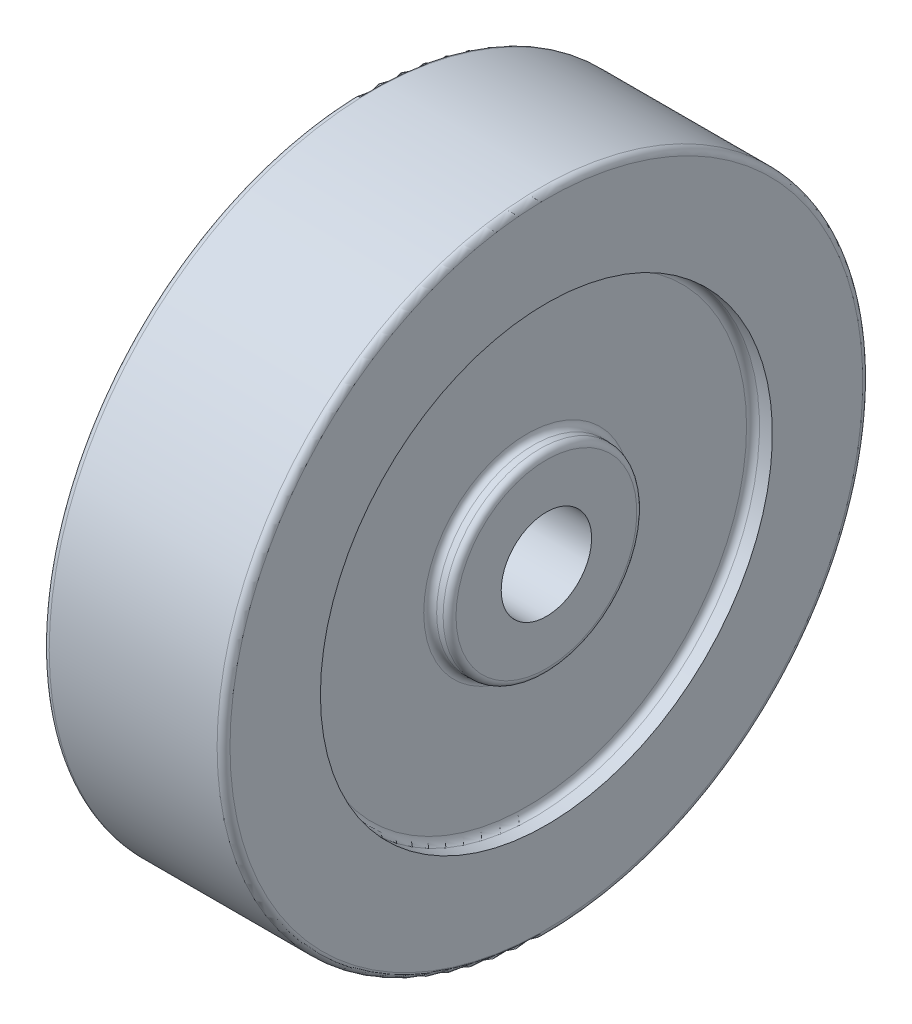
ISO-10303-21;
HEADER;
FILE_DESCRIPTION(('STEP AP214'),'2;1');
FILE_NAME('part.step','',(''),(''),'','','');
FILE_SCHEMA(('AUTOMOTIVE_DESIGN { 1 0 10303 214 1 1 1 1 }'));
ENDSEC;
DATA;
#1=APPLICATION_CONTEXT('core data for automotive mechanical design processes');
#2=APPLICATION_PROTOCOL_DEFINITION('international standard','automotive_design',2000,#1);
#3=PRODUCT_CONTEXT('',#1,'mechanical');
#4=PRODUCT('Part','Part','',(#3));
#5=PRODUCT_RELATED_PRODUCT_CATEGORY('part','',(#4));
#6=PRODUCT_DEFINITION_FORMATION('','',#4);
#7=PRODUCT_DEFINITION_CONTEXT('part definition',#1,'design');
#8=PRODUCT_DEFINITION('design','',#6,#7);
#9=PRODUCT_DEFINITION_SHAPE('','',#8);
#10=(LENGTH_UNIT() NAMED_UNIT(*) SI_UNIT(.MILLI.,.METRE.));
#11=(NAMED_UNIT(*) PLANE_ANGLE_UNIT() SI_UNIT($,.RADIAN.));
#12=(NAMED_UNIT(*) SI_UNIT($,.STERADIAN.) SOLID_ANGLE_UNIT());
#13=UNCERTAINTY_MEASURE_WITH_UNIT(LENGTH_MEASURE(1.E-05),#10,'distance_accuracy_value','');
#14=(GEOMETRIC_REPRESENTATION_CONTEXT(3) GLOBAL_UNCERTAINTY_ASSIGNED_CONTEXT((#13)) GLOBAL_UNIT_ASSIGNED_CONTEXT((#10,
#11,#12)) REPRESENTATION_CONTEXT('',''));
#15=CARTESIAN_POINT('',(0.,0.,0.));
#16=DIRECTION('',(0.,0.,1.));
#17=DIRECTION('',(1.,0.,0.));
#18=AXIS2_PLACEMENT_3D('',#15,#16,#17);
#19=CARTESIAN_POINT('',(-14.,15.,0.));
#20=DIRECTION('',(1.,0.,0.));
#21=DIRECTION('',(0.,0.,-1.));
#22=AXIS2_PLACEMENT_3D('',#19,#20,#21);
#23=PLANE('',#22);
#24=CARTESIAN_POINT('',(-14.,0.,0.));
#25=DIRECTION('',(1.,0.,0.));
#26=DIRECTION('',(0.,0.,-1.));
#27=AXIS2_PLACEMENT_3D('',#24,#25,#26);
#28=CIRCLE('',#27,14.);
#29=CARTESIAN_POINT('',(-14.,0.,-14.));
#30=VERTEX_POINT('',#29);
#31=EDGE_CURVE('E58',#30,#30,#28,.F.);
#32=ORIENTED_EDGE('',*,*,#31,.T.);
#33=EDGE_LOOP('',(#32));
#34=FACE_BOUND('',#33,.T.);
#35=CARTESIAN_POINT('',(-14.,0.,0.));
#36=DIRECTION('',(-1.,0.,0.));
#37=DIRECTION('',(0.,0.,1.));
#38=AXIS2_PLACEMENT_3D('',#35,#36,#37);
#39=CIRCLE('',#38,7.);
#40=CARTESIAN_POINT('',(-14.,0.,7.));
#41=VERTEX_POINT('',#40);
#42=EDGE_CURVE('E91',#41,#41,#39,.T.);
#43=ORIENTED_EDGE('',*,*,#42,.F.);
#44=EDGE_LOOP('',(#43));
#45=FACE_BOUND('',#44,.T.);
#46=ADVANCED_FACE('F35',(#34,#45),#23,.F.);
#47=CARTESIAN_POINT('',(0.,0.,0.));
#48=DIRECTION('',(-1.,0.,0.));
#49=DIRECTION('',(0.,0.,1.));
#50=AXIS2_PLACEMENT_3D('',#47,#48,#49);
#51=CYLINDRICAL_SURFACE('',#50,7.);
#52=CARTESIAN_POINT('',(14.,0.,0.));
#53=DIRECTION('',(-1.,0.,0.));
#54=DIRECTION('',(0.,0.,1.));
#55=AXIS2_PLACEMENT_3D('',#52,#53,#54);
#56=CIRCLE('',#55,7.00000000000001);
#57=CARTESIAN_POINT('',(14.,0.,7.00000000000001));
#58=VERTEX_POINT('',#57);
#59=EDGE_CURVE('E94',#58,#58,#56,.T.);
#60=ORIENTED_EDGE('',*,*,#59,.F.);
#61=EDGE_LOOP('',(#60));
#62=FACE_BOUND('',#61,.T.);
#63=ORIENTED_EDGE('',*,*,#42,.T.);
#64=EDGE_LOOP('',(#63));
#65=FACE_BOUND('',#64,.T.);
#66=ADVANCED_FACE('F121',(#62,#65),#51,.F.);
#67=CARTESIAN_POINT('',(14.,7.00000000000001,0.));
#68=DIRECTION('',(-1.,0.,0.));
#69=DIRECTION('',(0.,0.,1.));
#70=AXIS2_PLACEMENT_3D('',#67,#68,#69);
#71=PLANE('',#70);
#72=CARTESIAN_POINT('',(14.,0.,0.));
#73=DIRECTION('',(-1.,0.,0.));
#74=DIRECTION('',(0.,0.,1.));
#75=AXIS2_PLACEMENT_3D('',#72,#73,#74);
#76=CIRCLE('',#75,14.);
#77=CARTESIAN_POINT('',(14.,0.,14.));
#78=VERTEX_POINT('',#77);
#79=EDGE_CURVE('E73',#78,#78,#76,.F.);
#80=ORIENTED_EDGE('',*,*,#79,.T.);
#81=EDGE_LOOP('',(#80));
#82=FACE_BOUND('',#81,.T.);
#83=ORIENTED_EDGE('',*,*,#59,.T.);
#84=EDGE_LOOP('',(#83));
#85=FACE_BOUND('',#84,.T.);
#86=ADVANCED_FACE('F127',(#82,#85),#71,.F.);
#87=CARTESIAN_POINT('',(0.,0.,0.));
#88=DIRECTION('',(-1.,0.,0.));
#89=DIRECTION('',(0.,0.,1.));
#90=AXIS2_PLACEMENT_3D('',#87,#88,#89);
#91=CYLINDRICAL_SURFACE('',#90,15.);
#92=CARTESIAN_POINT('',(12.,0.,0.));
#93=DIRECTION('',(-1.,0.,0.));
#94=DIRECTION('',(0.,0.,1.));
#95=AXIS2_PLACEMENT_3D('',#92,#93,#94);
#96=CIRCLE('',#95,15.);
#97=CARTESIAN_POINT('',(12.,0.,15.));
#98=VERTEX_POINT('',#97);
#99=EDGE_CURVE('E76',#98,#98,#96,.F.);
#100=ORIENTED_EDGE('',*,*,#99,.T.);
#101=EDGE_LOOP('',(#100));
#102=FACE_BOUND('',#101,.T.);
#103=CARTESIAN_POINT('',(13.,0.,0.));
#104=DIRECTION('',(-1.,0.,0.));
#105=DIRECTION('',(0.,0.,1.));
#106=AXIS2_PLACEMENT_3D('',#103,#104,#105);
#107=CIRCLE('',#106,15.);
#108=CARTESIAN_POINT('',(13.,0.,15.));
#109=VERTEX_POINT('',#108);
#110=EDGE_CURVE('E79',#109,#109,#107,.T.);
#111=ORIENTED_EDGE('',*,*,#110,.T.);
#112=EDGE_LOOP('',(#111));
#113=FACE_BOUND('',#112,.T.);
#114=ADVANCED_FACE('F273',(#102,#113),#91,.T.);
#115=CARTESIAN_POINT('',(11.,15.,0.));
#116=DIRECTION('',(-1.,0.,0.));
#117=DIRECTION('',(0.,0.,1.));
#118=AXIS2_PLACEMENT_3D('',#115,#116,#117);
#119=PLANE('',#118);
#120=CARTESIAN_POINT('',(11.,0.,0.));
#121=DIRECTION('',(-1.,0.,0.));
#122=DIRECTION('',(0.,0.,1.));
#123=AXIS2_PLACEMENT_3D('',#120,#121,#122);
#124=CIRCLE('',#123,34.);
#125=CARTESIAN_POINT('',(11.,0.,34.));
#126=VERTEX_POINT('',#125);
#127=EDGE_CURVE('E82',#126,#126,#124,.F.);
#128=ORIENTED_EDGE('',*,*,#127,.T.);
#129=EDGE_LOOP('',(#128));
#130=FACE_BOUND('',#129,.T.);
#131=CARTESIAN_POINT('',(11.,0.,0.));
#132=DIRECTION('',(-1.,0.,0.));
#133=DIRECTION('',(0.,0.,1.));
#134=AXIS2_PLACEMENT_3D('',#131,#132,#133);
#135=CIRCLE('',#134,16.);
#136=CARTESIAN_POINT('',(11.,0.,16.));
#137=VERTEX_POINT('',#136);
#138=EDGE_CURVE('E85',#137,#137,#135,.T.);
#139=ORIENTED_EDGE('',*,*,#138,.T.);
#140=EDGE_LOOP('',(#139));
#141=FACE_BOUND('',#140,.T.);
#142=ADVANCED_FACE('F263',(#130,#141),#119,.F.);
#143=CARTESIAN_POINT('',(0.,0.,0.));
#144=DIRECTION('',(-1.,0.,0.));
#145=DIRECTION('',(0.,0.,1.));
#146=AXIS2_PLACEMENT_3D('',#143,#144,#145);
#147=CYLINDRICAL_SURFACE('',#146,35.);
#148=CARTESIAN_POINT('',(12.,0.,0.));
#149=DIRECTION('',(-1.,0.,0.));
#150=DIRECTION('',(0.,0.,1.));
#151=AXIS2_PLACEMENT_3D('',#148,#149,#150);
#152=CIRCLE('',#151,35.);
#153=CARTESIAN_POINT('',(12.,0.,35.));
#154=VERTEX_POINT('',#153);
#155=EDGE_CURVE('E88',#154,#154,#152,.T.);
#156=ORIENTED_EDGE('',*,*,#155,.T.);
#157=EDGE_LOOP('',(#156));
#158=FACE_BOUND('',#157,.T.);
#159=CARTESIAN_POINT('',(14.,0.,0.));
#160=DIRECTION('',(-1.,0.,0.));
#161=DIRECTION('',(0.,0.,1.));
#162=AXIS2_PLACEMENT_3D('',#159,#160,#161);
#163=CIRCLE('',#162,35.);
#164=CARTESIAN_POINT('',(14.,0.,35.));
#165=VERTEX_POINT('',#164);
#166=EDGE_CURVE('E97',#165,#165,#163,.T.);
#167=ORIENTED_EDGE('',*,*,#166,.F.);
#168=EDGE_LOOP('',(#167));
#169=FACE_BOUND('',#168,.T.);
#170=ADVANCED_FACE('F254',(#158,#169),#147,.F.);
#171=CARTESIAN_POINT('',(14.,35.,0.));
#172=DIRECTION('',(-1.,0.,0.));
#173=DIRECTION('',(0.,0.,1.));
#174=AXIS2_PLACEMENT_3D('',#171,#172,#173);
#175=PLANE('',#174);
#176=CARTESIAN_POINT('',(14.,0.,0.));
#177=DIRECTION('',(-1.,0.,0.));
#178=DIRECTION('',(0.,0.,1.));
#179=AXIS2_PLACEMENT_3D('',#176,#177,#178);
#180=CIRCLE('',#179,49.);
#181=CARTESIAN_POINT('',(14.,0.,49.));
#182=VERTEX_POINT('',#181);
#183=EDGE_CURVE('E42',#182,#182,#180,.F.);
#184=ORIENTED_EDGE('',*,*,#183,.T.);
#185=EDGE_LOOP('',(#184));
#186=FACE_BOUND('',#185,.T.);
#187=ORIENTED_EDGE('',*,*,#166,.T.);
#188=EDGE_LOOP('',(#187));
#189=FACE_BOUND('',#188,.T.);
#190=ADVANCED_FACE('F117',(#186,#189),#175,.F.);
#191=CARTESIAN_POINT('',(0.,0.,0.));
#192=DIRECTION('',(-1.,0.,0.));
#193=DIRECTION('',(0.,0.,1.));
#194=AXIS2_PLACEMENT_3D('',#191,#192,#193);
#195=CYLINDRICAL_SURFACE('',#194,50.);
#196=CARTESIAN_POINT('',(13.,0.,0.));
#197=DIRECTION('',(-1.,0.,0.));
#198=DIRECTION('',(0.,0.,1.));
#199=AXIS2_PLACEMENT_3D('',#196,#197,#198);
#200=CIRCLE('',#199,50.);
#201=CARTESIAN_POINT('',(13.,0.,50.));
#202=VERTEX_POINT('',#201);
#203=EDGE_CURVE('E46',#202,#202,#200,.T.);
#204=ORIENTED_EDGE('',*,*,#203,.T.);
#205=EDGE_LOOP('',(#204));
#206=FACE_BOUND('',#205,.T.);
#207=CARTESIAN_POINT('',(-13.,0.,0.));
#208=DIRECTION('',(1.,0.,0.));
#209=DIRECTION('',(0.,0.,-1.));
#210=AXIS2_PLACEMENT_3D('',#207,#208,#209);
#211=CIRCLE('',#210,50.);
#212=CARTESIAN_POINT('',(-13.,0.,-50.));
#213=VERTEX_POINT('',#212);
#214=EDGE_CURVE('E50',#213,#213,#211,.T.);
#215=ORIENTED_EDGE('',*,*,#214,.T.);
#216=EDGE_LOOP('',(#215));
#217=FACE_BOUND('',#216,.T.);
#218=ADVANCED_FACE('F108',(#206,#217),#195,.T.);
#219=CARTESIAN_POINT('',(-14.,50.,0.));
#220=DIRECTION('',(1.,0.,0.));
#221=DIRECTION('',(0.,0.,-1.));
#222=AXIS2_PLACEMENT_3D('',#219,#220,#221);
#223=PLANE('',#222);
#224=CARTESIAN_POINT('',(-14.,0.,0.));
#225=DIRECTION('',(1.,0.,0.));
#226=DIRECTION('',(0.,0.,-1.));
#227=AXIS2_PLACEMENT_3D('',#224,#225,#226);
#228=CIRCLE('',#227,49.);
#229=CARTESIAN_POINT('',(-14.,0.,-49.));
#230=VERTEX_POINT('',#229);
#231=EDGE_CURVE('E10',#230,#230,#228,.F.);
#232=ORIENTED_EDGE('',*,*,#231,.T.);
#233=EDGE_LOOP('',(#232));
#234=FACE_BOUND('',#233,.T.);
#235=CARTESIAN_POINT('',(-14.,0.,0.));
#236=DIRECTION('',(-1.,0.,0.));
#237=DIRECTION('',(0.,0.,1.));
#238=AXIS2_PLACEMENT_3D('',#235,#236,#237);
#239=CIRCLE('',#238,35.);
#240=CARTESIAN_POINT('',(-14.,0.,35.));
#241=VERTEX_POINT('',#240);
#242=EDGE_CURVE('E100',#241,#241,#239,.T.);
#243=ORIENTED_EDGE('',*,*,#242,.F.);
#244=EDGE_LOOP('',(#243));
#245=FACE_BOUND('',#244,.T.);
#246=ADVANCED_FACE('F106',(#234,#245),#223,.F.);
#247=CARTESIAN_POINT('',(0.,0.,0.));
#248=DIRECTION('',(-1.,0.,0.));
#249=DIRECTION('',(0.,0.,1.));
#250=AXIS2_PLACEMENT_3D('',#247,#248,#249);
#251=CYLINDRICAL_SURFACE('',#250,35.);
#252=CARTESIAN_POINT('',(-12.,0.,0.));
#253=DIRECTION('',(1.,0.,0.));
#254=DIRECTION('',(0.,0.,-1.));
#255=AXIS2_PLACEMENT_3D('',#252,#253,#254);
#256=CIRCLE('',#255,35.);
#257=CARTESIAN_POINT('',(-12.,0.,-35.));
#258=VERTEX_POINT('',#257);
#259=EDGE_CURVE('E55',#258,#258,#256,.T.);
#260=ORIENTED_EDGE('',*,*,#259,.T.);
#261=EDGE_LOOP('',(#260));
#262=FACE_BOUND('',#261,.T.);
#263=ORIENTED_EDGE('',*,*,#242,.T.);
#264=EDGE_LOOP('',(#263));
#265=FACE_BOUND('',#264,.T.);
#266=ADVANCED_FACE('F104',(#262,#265),#251,.F.);
#267=CARTESIAN_POINT('',(-11.,35.,0.));
#268=DIRECTION('',(1.,0.,0.));
#269=DIRECTION('',(0.,0.,-1.));
#270=AXIS2_PLACEMENT_3D('',#267,#268,#269);
#271=PLANE('',#270);
#272=CARTESIAN_POINT('',(-11.,0.,0.));
#273=DIRECTION('',(1.,0.,0.));
#274=DIRECTION('',(0.,0.,-1.));
#275=AXIS2_PLACEMENT_3D('',#272,#273,#274);
#276=CIRCLE('',#275,16.);
#277=CARTESIAN_POINT('',(-11.,0.,-16.));
#278=VERTEX_POINT('',#277);
#279=EDGE_CURVE('E61',#278,#278,#276,.T.);
#280=ORIENTED_EDGE('',*,*,#279,.T.);
#281=EDGE_LOOP('',(#280));
#282=FACE_BOUND('',#281,.T.);
#283=CARTESIAN_POINT('',(-11.,0.,0.));
#284=DIRECTION('',(1.,0.,0.));
#285=DIRECTION('',(0.,0.,-1.));
#286=AXIS2_PLACEMENT_3D('',#283,#284,#285);
#287=CIRCLE('',#286,34.);
#288=CARTESIAN_POINT('',(-11.,0.,-34.));
#289=VERTEX_POINT('',#288);
#290=EDGE_CURVE('E64',#289,#289,#287,.F.);
#291=ORIENTED_EDGE('',*,*,#290,.T.);
#292=EDGE_LOOP('',(#291));
#293=FACE_BOUND('',#292,.T.);
#294=ADVANCED_FACE('F114',(#282,#293),#271,.F.);
#295=CARTESIAN_POINT('',(0.,0.,0.));
#296=DIRECTION('',(-1.,0.,0.));
#297=DIRECTION('',(0.,0.,1.));
#298=AXIS2_PLACEMENT_3D('',#295,#296,#297);
#299=CYLINDRICAL_SURFACE('',#298,15.);
#300=CARTESIAN_POINT('',(-12.,0.,0.));
#301=DIRECTION('',(1.,0.,0.));
#302=DIRECTION('',(0.,0.,-1.));
#303=AXIS2_PLACEMENT_3D('',#300,#301,#302);
#304=CIRCLE('',#303,15.);
#305=CARTESIAN_POINT('',(-12.,0.,-15.));
#306=VERTEX_POINT('',#305);
#307=EDGE_CURVE('E67',#306,#306,#304,.F.);
#308=ORIENTED_EDGE('',*,*,#307,.T.);
#309=EDGE_LOOP('',(#308));
#310=FACE_BOUND('',#309,.T.);
#311=CARTESIAN_POINT('',(-13.,0.,0.));
#312=DIRECTION('',(1.,0.,0.));
#313=DIRECTION('',(0.,0.,-1.));
#314=AXIS2_PLACEMENT_3D('',#311,#312,#313);
#315=CIRCLE('',#314,15.);
#316=CARTESIAN_POINT('',(-13.,0.,-15.));
#317=VERTEX_POINT('',#316);
#318=EDGE_CURVE('E70',#317,#317,#315,.T.);
#319=ORIENTED_EDGE('',*,*,#318,.T.);
#320=EDGE_LOOP('',(#319));
#321=FACE_BOUND('',#320,.T.);
#322=ADVANCED_FACE('F137',(#310,#321),#299,.T.);
#323=CARTESIAN_POINT('',(12.,0.,0.));
#324=DIRECTION('',(-1.,0.,0.));
#325=DIRECTION('',(0.,0.,1.));
#326=AXIS2_PLACEMENT_3D('',#323,#324,#325);
#327=TOROIDAL_SURFACE('',#326,34.,1.);
#328=ORIENTED_EDGE('',*,*,#127,.F.);
#329=EDGE_LOOP('',(#328));
#330=FACE_BOUND('',#329,.T.);
#331=ORIENTED_EDGE('',*,*,#155,.F.);
#332=EDGE_LOOP('',(#331));
#333=FACE_BOUND('',#332,.T.);
#334=ADVANCED_FACE('F133',(#330,#333),#327,.F.);
#335=CARTESIAN_POINT('',(12.,0.,0.));
#336=DIRECTION('',(-1.,0.,0.));
#337=DIRECTION('',(0.,0.,1.));
#338=AXIS2_PLACEMENT_3D('',#335,#336,#337);
#339=TOROIDAL_SURFACE('',#338,16.,1.);
#340=ORIENTED_EDGE('',*,*,#99,.F.);
#341=EDGE_LOOP('',(#340));
#342=FACE_BOUND('',#341,.T.);
#343=ORIENTED_EDGE('',*,*,#138,.F.);
#344=EDGE_LOOP('',(#343));
#345=FACE_BOUND('',#344,.T.);
#346=ADVANCED_FACE('F136',(#342,#345),#339,.F.);
#347=CARTESIAN_POINT('',(13.,0.,0.));
#348=DIRECTION('',(-1.,0.,0.));
#349=DIRECTION('',(0.,0.,1.));
#350=AXIS2_PLACEMENT_3D('',#347,#348,#349);
#351=TOROIDAL_SURFACE('',#350,14.,1.);
#352=ORIENTED_EDGE('',*,*,#79,.F.);
#353=EDGE_LOOP('',(#352));
#354=FACE_BOUND('',#353,.T.);
#355=ORIENTED_EDGE('',*,*,#110,.F.);
#356=EDGE_LOOP('',(#355));
#357=FACE_BOUND('',#356,.T.);
#358=ADVANCED_FACE('F141',(#354,#357),#351,.T.);
#359=CARTESIAN_POINT('',(-12.,0.,0.));
#360=DIRECTION('',(1.,0.,0.));
#361=DIRECTION('',(0.,0.,-1.));
#362=AXIS2_PLACEMENT_3D('',#359,#360,#361);
#363=TOROIDAL_SURFACE('',#362,16.,1.);
#364=ORIENTED_EDGE('',*,*,#279,.F.);
#365=EDGE_LOOP('',(#364));
#366=FACE_BOUND('',#365,.T.);
#367=ORIENTED_EDGE('',*,*,#307,.F.);
#368=EDGE_LOOP('',(#367));
#369=FACE_BOUND('',#368,.T.);
#370=ADVANCED_FACE('F145',(#366,#369),#363,.F.);
#371=CARTESIAN_POINT('',(-13.,0.,0.));
#372=DIRECTION('',(1.,0.,0.));
#373=DIRECTION('',(0.,0.,-1.));
#374=AXIS2_PLACEMENT_3D('',#371,#372,#373);
#375=TOROIDAL_SURFACE('',#374,14.,1.);
#376=ORIENTED_EDGE('',*,*,#318,.F.);
#377=EDGE_LOOP('',(#376));
#378=FACE_BOUND('',#377,.T.);
#379=ORIENTED_EDGE('',*,*,#31,.F.);
#380=EDGE_LOOP('',(#379));
#381=FACE_BOUND('',#380,.T.);
#382=ADVANCED_FACE('F149',(#378,#381),#375,.T.);
#383=CARTESIAN_POINT('',(-12.,0.,0.));
#384=DIRECTION('',(1.,0.,0.));
#385=DIRECTION('',(0.,0.,-1.));
#386=AXIS2_PLACEMENT_3D('',#383,#384,#385);
#387=TOROIDAL_SURFACE('',#386,34.,1.);
#388=ORIENTED_EDGE('',*,*,#259,.F.);
#389=EDGE_LOOP('',(#388));
#390=FACE_BOUND('',#389,.T.);
#391=ORIENTED_EDGE('',*,*,#290,.F.);
#392=EDGE_LOOP('',(#391));
#393=FACE_BOUND('',#392,.T.);
#394=ADVANCED_FACE('F153',(#390,#393),#387,.F.);
#395=CARTESIAN_POINT('',(13.,0.,0.));
#396=DIRECTION('',(-1.,0.,0.));
#397=DIRECTION('',(0.,0.,1.));
#398=AXIS2_PLACEMENT_3D('',#395,#396,#397);
#399=TOROIDAL_SURFACE('',#398,49.,1.);
#400=ORIENTED_EDGE('',*,*,#183,.F.);
#401=EDGE_LOOP('',(#400));
#402=FACE_BOUND('',#401,.T.);
#403=ORIENTED_EDGE('',*,*,#203,.F.);
#404=EDGE_LOOP('',(#403));
#405=FACE_BOUND('',#404,.T.);
#406=ADVANCED_FACE('F156',(#402,#405),#399,.T.);
#407=CARTESIAN_POINT('',(-13.,0.,0.));
#408=DIRECTION('',(1.,0.,0.));
#409=DIRECTION('',(0.,0.,-1.));
#410=AXIS2_PLACEMENT_3D('',#407,#408,#409);
#411=TOROIDAL_SURFACE('',#410,49.,1.);
#412=ORIENTED_EDGE('',*,*,#214,.F.);
#413=EDGE_LOOP('',(#412));
#414=FACE_BOUND('',#413,.T.);
#415=ORIENTED_EDGE('',*,*,#231,.F.);
#416=EDGE_LOOP('',(#415));
#417=FACE_BOUND('',#416,.T.);
#418=ADVANCED_FACE('F37',(#414,#417),#411,.T.);
#419=CLOSED_SHELL('',(#46,#66,#86,#114,#142,#170,#190,#218,#246,#266,#294,#322,#334,#346,#358,
#370,#382,#394,#406,#418));
#420=MANIFOLD_SOLID_BREP('B2',#419);
#421=ADVANCED_BREP_SHAPE_REPRESENTATION('',(#18,#420),#14);
#422=SHAPE_DEFINITION_REPRESENTATION(#9,#421);
ENDSEC;
END-ISO-10303-21;
